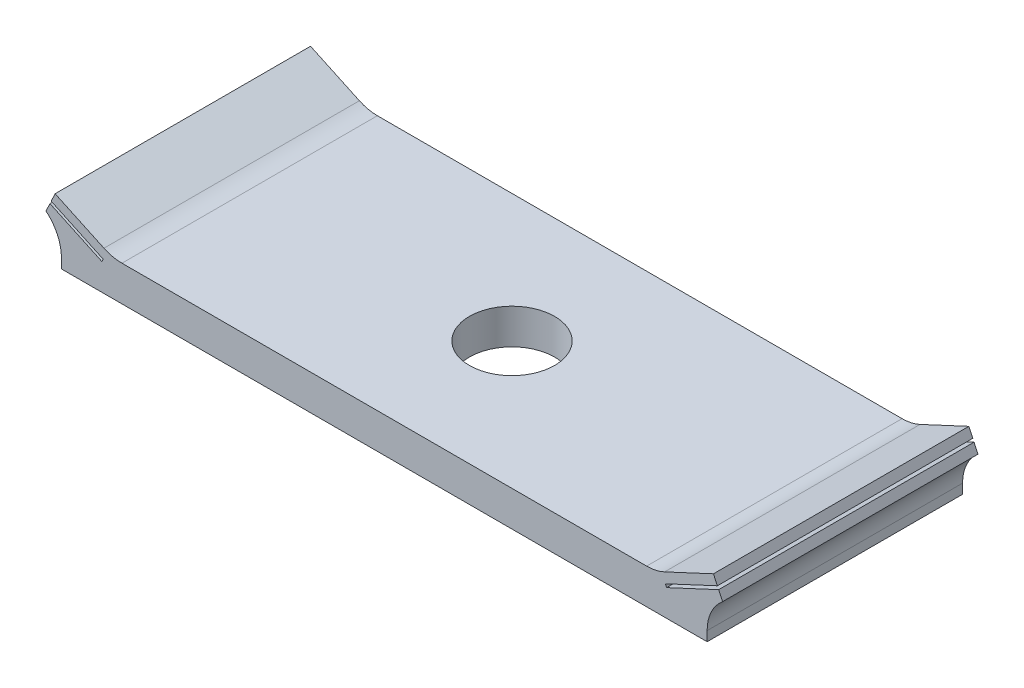
ISO-10303-21;
HEADER;
FILE_DESCRIPTION(('STEP AP214'),'2;1');
FILE_NAME('part.step','',(''),(''),'','','');
FILE_SCHEMA(('AUTOMOTIVE_DESIGN { 1 0 10303 214 1 1 1 1 }'));
ENDSEC;
DATA;
#1=APPLICATION_CONTEXT('core data for automotive mechanical design processes');
#2=APPLICATION_PROTOCOL_DEFINITION('international standard','automotive_design',2000,#1);
#3=PRODUCT_CONTEXT('',#1,'mechanical');
#4=PRODUCT('Part','Part','',(#3));
#5=PRODUCT_RELATED_PRODUCT_CATEGORY('part','',(#4));
#6=PRODUCT_DEFINITION_FORMATION('','',#4);
#7=PRODUCT_DEFINITION_CONTEXT('part definition',#1,'design');
#8=PRODUCT_DEFINITION('design','',#6,#7);
#9=PRODUCT_DEFINITION_SHAPE('','',#8);
#10=(LENGTH_UNIT() NAMED_UNIT(*) SI_UNIT(.MILLI.,.METRE.));
#11=(NAMED_UNIT(*) PLANE_ANGLE_UNIT() SI_UNIT($,.RADIAN.));
#12=(NAMED_UNIT(*) SI_UNIT($,.STERADIAN.) SOLID_ANGLE_UNIT());
#13=UNCERTAINTY_MEASURE_WITH_UNIT(LENGTH_MEASURE(1.E-05),#10,'distance_accuracy_value','');
#14=(GEOMETRIC_REPRESENTATION_CONTEXT(3) GLOBAL_UNCERTAINTY_ASSIGNED_CONTEXT((#13)) GLOBAL_UNIT_ASSIGNED_CONTEXT((#10,
#11,#12)) REPRESENTATION_CONTEXT('',''));
#15=CARTESIAN_POINT('',(0.,0.,0.));
#16=DIRECTION('',(0.,0.,1.));
#17=DIRECTION('',(1.,0.,0.));
#18=AXIS2_PLACEMENT_3D('',#15,#16,#17);
#19=CARTESIAN_POINT('',(0.,2.070510621828,30.));
#20=DIRECTION('',(0.,1.,0.));
#21=DIRECTION('',(0.,0.,1.));
#22=AXIS2_PLACEMENT_3D('',#19,#20,#21);
#23=PLANE('',#22);
#24=CARTESIAN_POINT('',(0.,2.070510621828,15.));
#25=DIRECTION('',(0.,1.,0.));
#26=DIRECTION('',(0.,0.,1.));
#27=AXIS2_PLACEMENT_3D('',#24,#25,#26);
#28=CIRCLE('',#27,5.);
#29=CARTESIAN_POINT('',(0.,2.070510621828,20.));
#30=VERTEX_POINT('',#29);
#31=EDGE_CURVE('E476',#30,#30,#28,.T.);
#32=ORIENTED_EDGE('',*,*,#31,.F.);
#33=EDGE_LOOP('',(#32));
#34=FACE_BOUND('',#33,.T.);
#35=DIRECTION('',(1.,0.,0.));
#36=VECTOR('',#35,1.);
#37=CARTESIAN_POINT('',(0.,2.070510621828,30.));
#38=LINE('',#37,#36);
#39=CARTESIAN_POINT('',(-30.8115266867853,2.070510621828,30.));
#40=VERTEX_POINT('',#39);
#41=CARTESIAN_POINT('',(30.8115266867853,2.070510621828,30.));
#42=VERTEX_POINT('',#41);
#43=EDGE_CURVE('E200',#40,#42,#38,.T.);
#44=ORIENTED_EDGE('',*,*,#43,.T.);
#45=DIRECTION('',(0.,0.,-1.));
#46=VECTOR('',#45,1.);
#47=CARTESIAN_POINT('',(30.8115266867853,2.070510621828,30.));
#48=LINE('',#47,#46);
#49=CARTESIAN_POINT('',(30.8115266867853,2.070510621828,0.));
#50=VERTEX_POINT('',#49);
#51=EDGE_CURVE('E364',#42,#50,#48,.T.);
#52=ORIENTED_EDGE('',*,*,#51,.T.);
#53=DIRECTION('',(1.,0.,0.));
#54=VECTOR('',#53,1.);
#55=CARTESIAN_POINT('',(0.,2.070510621828,0.));
#56=LINE('',#55,#54);
#57=CARTESIAN_POINT('',(-30.8115266867853,2.070510621828,0.));
#58=VERTEX_POINT('',#57);
#59=EDGE_CURVE('E255',#58,#50,#56,.T.);
#60=ORIENTED_EDGE('',*,*,#59,.F.);
#61=DIRECTION('',(0.,0.,-1.));
#62=VECTOR('',#61,1.);
#63=CARTESIAN_POINT('',(-30.8115266867853,2.070510621828,30.));
#64=LINE('',#63,#62);
#65=EDGE_CURVE('E361',#58,#40,#64,.F.);
#66=ORIENTED_EDGE('',*,*,#65,.T.);
#67=EDGE_LOOP('',(#44,#52,#60,#66));
#68=FACE_BOUND('',#67,.T.);
#69=ADVANCED_FACE('F45',(#34,#68),#23,.T.);
#70=CARTESIAN_POINT('',(-4.90805817126778,-10.5253647145472,30.));
#71=DIRECTION('',(0.422618261740701,0.906307787036649,0.));
#72=DIRECTION('',(-0.906307787036649,0.422618261740701,0.));
#73=AXIS2_PLACEMENT_3D('',#70,#71,#72);
#74=PLANE('',#73);
#75=DIRECTION('',(0.90630778703665,-0.422618261740701,0.));
#76=VECTOR('',#75,1.);
#77=CARTESIAN_POINT('',(-4.90805817126778,-10.5253647145472,30.));
#78=LINE('',#77,#76);
#79=CARTESIAN_POINT('',(-38.6609784031329,5.21388047466634,30.));
#80=VERTEX_POINT('',#79);
#81=CARTESIAN_POINT('',(-32.9246179954888,2.53897168664476,30.));
#82=VERTEX_POINT('',#81);
#83=EDGE_CURVE('E185',#80,#82,#78,.T.);
#84=ORIENTED_EDGE('',*,*,#83,.T.);
#85=DIRECTION('',(0.,0.,-1.));
#86=VECTOR('',#85,1.);
#87=CARTESIAN_POINT('',(-32.9246179954888,2.53897168664475,0.));
#88=LINE('',#87,#86);
#89=CARTESIAN_POINT('',(-32.9246179954888,2.53897168664476,0.));
#90=VERTEX_POINT('',#89);
#91=EDGE_CURVE('E371',#82,#90,#88,.T.);
#92=ORIENTED_EDGE('',*,*,#91,.T.);
#93=DIRECTION('',(0.90630778703665,-0.422618261740701,0.));
#94=VECTOR('',#93,1.);
#95=CARTESIAN_POINT('',(-4.90805817126778,-10.5253647145472,0.));
#96=LINE('',#95,#94);
#97=CARTESIAN_POINT('',(-38.6609784031329,5.21388047466634,0.));
#98=VERTEX_POINT('',#97);
#99=EDGE_CURVE('E187',#98,#90,#96,.T.);
#100=ORIENTED_EDGE('',*,*,#99,.F.);
#101=DIRECTION('',(0.,0.,-1.));
#102=VECTOR('',#101,1.);
#103=CARTESIAN_POINT('',(-38.6609784031329,5.21388047466634,30.));
#104=LINE('',#103,#102);
#105=EDGE_CURVE('E183',#80,#98,#104,.T.);
#106=ORIENTED_EDGE('',*,*,#105,.F.);
#107=EDGE_LOOP('',(#84,#92,#100,#106));
#108=FACE_BOUND('',#107,.T.);
#109=ADVANCED_FACE('F184',(#108),#74,.T.);
#110=CARTESIAN_POINT('',(-33.7529202318651,15.7392451892135,30.));
#111=DIRECTION('',(-0.906307787036649,0.4226182617407,0.));
#112=DIRECTION('',(-0.4226182617407,-0.906307787036649,0.));
#113=AXIS2_PLACEMENT_3D('',#110,#111,#112);
#114=PLANE('',#113);
#115=DIRECTION('',(0.4226182617407,0.90630778703665,0.));
#116=VECTOR('',#115,1.);
#117=CARTESIAN_POINT('',(-33.7529202318651,15.7392451892135,0.));
#118=LINE('',#117,#116);
#119=CARTESIAN_POINT('',(-39.1228387927985,4.22341767271929,0.));
#120=VERTEX_POINT('',#119);
#121=EDGE_CURVE('E261',#120,#98,#118,.T.);
#122=ORIENTED_EDGE('',*,*,#121,.F.);
#123=DIRECTION('',(0.,0.,-1.));
#124=VECTOR('',#123,1.);
#125=CARTESIAN_POINT('',(-39.1228387927985,4.22341767271929,30.));
#126=LINE('',#125,#124);
#127=CARTESIAN_POINT('',(-39.1228387927985,4.22341767271929,30.));
#128=VERTEX_POINT('',#127);
#129=EDGE_CURVE('E194',#128,#120,#126,.T.);
#130=ORIENTED_EDGE('',*,*,#129,.F.);
#131=DIRECTION('',(0.4226182617407,0.90630778703665,0.));
#132=VECTOR('',#131,1.);
#133=CARTESIAN_POINT('',(-33.7529202318651,15.7392451892135,30.));
#134=LINE('',#133,#132);
#135=EDGE_CURVE('E198',#128,#80,#134,.T.);
#136=ORIENTED_EDGE('',*,*,#135,.T.);
#137=ORIENTED_EDGE('',*,*,#105,.T.);
#138=EDGE_LOOP('',(#122,#130,#136,#137));
#139=FACE_BOUND('',#138,.T.);
#140=ADVANCED_FACE('F202',(#139),#114,.T.);
#141=CARTESIAN_POINT('',(-5.36991856093337,-11.5158275164943,30.));
#142=DIRECTION('',(0.422618261740701,0.906307787036649,0.));
#143=DIRECTION('',(-0.906307787036649,0.422618261740701,0.));
#144=AXIS2_PLACEMENT_3D('',#141,#142,#143);
#145=PLANE('',#144);
#146=DIRECTION('',(0.906307787036649,-0.422618261740701,0.));
#147=VECTOR('',#146,1.);
#148=CARTESIAN_POINT('',(-5.36991856093337,-11.5158275164943,0.));
#149=LINE('',#148,#147);
#150=CARTESIAN_POINT('',(-33.0143243081715,1.37497058858696,0.));
#151=VERTEX_POINT('',#150);
#152=EDGE_CURVE('E264',#120,#151,#149,.T.);
#153=ORIENTED_EDGE('',*,*,#152,.T.);
#154=DIRECTION('',(0.,0.,-1.));
#155=VECTOR('',#154,1.);
#156=CARTESIAN_POINT('',(-33.0143243081715,1.37497058858696,30.));
#157=LINE('',#156,#155);
#158=CARTESIAN_POINT('',(-33.0143243081715,1.37497058858696,30.));
#159=VERTEX_POINT('',#158);
#160=EDGE_CURVE('E349',#159,#151,#157,.T.);
#161=ORIENTED_EDGE('',*,*,#160,.F.);
#162=DIRECTION('',(0.906307787036649,-0.422618261740701,0.));
#163=VECTOR('',#162,1.);
#164=CARTESIAN_POINT('',(-5.36991856093337,-11.5158275164943,30.));
#165=LINE('',#164,#163);
#166=EDGE_CURVE('E205',#128,#159,#165,.T.);
#167=ORIENTED_EDGE('',*,*,#166,.F.);
#168=ORIENTED_EDGE('',*,*,#129,.T.);
#169=EDGE_LOOP('',(#153,#161,#167,#168));
#170=FACE_BOUND('',#169,.T.);
#171=ADVANCED_FACE('F506',(#170),#145,.F.);
#172=CARTESIAN_POINT('',(-27.6444057472382,12.8907981050811,30.));
#173=DIRECTION('',(0.906307787036652,-0.422618261740695,0.));
#174=DIRECTION('',(0.422618261740695,0.906307787036652,0.));
#175=AXIS2_PLACEMENT_3D('',#172,#173,#174);
#176=PLANE('',#175);
#177=DIRECTION('',(-0.422618261740695,-0.906307787036652,0.));
#178=VECTOR('',#177,1.);
#179=CARTESIAN_POINT('',(-27.6444057472382,12.8907981050811,0.));
#180=LINE('',#179,#178);
#181=CARTESIAN_POINT('',(-33.1622406997807,1.05776286312413,0.));
#182=VERTEX_POINT('',#181);
#183=EDGE_CURVE('E267',#151,#182,#180,.T.);
#184=ORIENTED_EDGE('',*,*,#183,.T.);
#185=DIRECTION('',(0.,0.,-1.));
#186=VECTOR('',#185,1.);
#187=CARTESIAN_POINT('',(-33.1622406997807,1.05776286312413,30.));
#188=LINE('',#187,#186);
#189=CARTESIAN_POINT('',(-33.1622406997807,1.05776286312413,30.));
#190=VERTEX_POINT('',#189);
#191=EDGE_CURVE('E345',#190,#182,#188,.T.);
#192=ORIENTED_EDGE('',*,*,#191,.F.);
#193=DIRECTION('',(-0.422618261740695,-0.906307787036652,0.));
#194=VECTOR('',#193,1.);
#195=CARTESIAN_POINT('',(-27.6444057472382,12.8907981050811,30.));
#196=LINE('',#195,#194);
#197=EDGE_CURVE('E208',#159,#190,#196,.T.);
#198=ORIENTED_EDGE('',*,*,#197,.F.);
#199=ORIENTED_EDGE('',*,*,#160,.T.);
#200=EDGE_LOOP('',(#184,#192,#198,#199));
#201=FACE_BOUND('',#200,.T.);
#202=ADVANCED_FACE('F502',(#201),#176,.F.);
#203=CARTESIAN_POINT('',(-5.51783495254257,-11.8330352419571,30.));
#204=DIRECTION('',(-0.4226182617407,-0.90630778703665,0.));
#205=DIRECTION('',(0.90630778703665,-0.4226182617407,0.));
#206=AXIS2_PLACEMENT_3D('',#203,#204,#205);
#207=PLANE('',#206);
#208=DIRECTION('',(-0.90630778703665,0.4226182617407,0.));
#209=VECTOR('',#208,1.);
#210=CARTESIAN_POINT('',(-5.51783495254257,-11.8330352419571,0.));
#211=LINE('',#210,#209);
#212=CARTESIAN_POINT('',(-39.2707551844077,3.90620994725645,0.));
#213=VERTEX_POINT('',#212);
#214=EDGE_CURVE('E270',#182,#213,#211,.T.);
#215=ORIENTED_EDGE('',*,*,#214,.T.);
#216=DIRECTION('',(0.,0.,-1.));
#217=VECTOR('',#216,1.);
#218=CARTESIAN_POINT('',(-39.2707551844077,3.90620994725645,30.));
#219=LINE('',#218,#217);
#220=CARTESIAN_POINT('',(-39.2707551844077,3.90620994725645,30.));
#221=VERTEX_POINT('',#220);
#222=EDGE_CURVE('E342',#221,#213,#219,.T.);
#223=ORIENTED_EDGE('',*,*,#222,.F.);
#224=DIRECTION('',(-0.90630778703665,0.4226182617407,0.));
#225=VECTOR('',#224,1.);
#226=CARTESIAN_POINT('',(-5.51783495254257,-11.8330352419571,30.));
#227=LINE('',#226,#225);
#228=EDGE_CURVE('E214',#190,#221,#227,.T.);
#229=ORIENTED_EDGE('',*,*,#228,.F.);
#230=ORIENTED_EDGE('',*,*,#191,.T.);
#231=EDGE_LOOP('',(#215,#223,#229,#230));
#232=FACE_BOUND('',#231,.T.);
#233=ADVANCED_FACE('F498',(#232),#207,.F.);
#234=CARTESIAN_POINT('',(-33.7529202318651,15.7392451892135,30.));
#235=DIRECTION('',(-0.906307787036649,0.4226182617407,0.));
#236=DIRECTION('',(-0.4226182617407,-0.906307787036649,0.));
#237=AXIS2_PLACEMENT_3D('',#234,#235,#236);
#238=PLANE('',#237);
#239=DIRECTION('',(0.4226182617407,0.90630778703665,0.));
#240=VECTOR('',#239,1.);
#241=CARTESIAN_POINT('',(-33.7529202318651,15.7392451892135,0.));
#242=LINE('',#241,#240);
#243=CARTESIAN_POINT('',(-39.7326155740733,2.9157471453094,0.));
#244=VERTEX_POINT('',#243);
#245=EDGE_CURVE('E274',#244,#213,#242,.T.);
#246=ORIENTED_EDGE('',*,*,#245,.F.);
#247=DIRECTION('',(0.,0.,-1.));
#248=VECTOR('',#247,1.);
#249=CARTESIAN_POINT('',(-39.7326155740733,2.9157471453094,30.));
#250=LINE('',#249,#248);
#251=CARTESIAN_POINT('',(-39.7326155740733,2.9157471453094,30.));
#252=VERTEX_POINT('',#251);
#253=EDGE_CURVE('E338',#252,#244,#250,.T.);
#254=ORIENTED_EDGE('',*,*,#253,.F.);
#255=DIRECTION('',(0.4226182617407,0.90630778703665,0.));
#256=VECTOR('',#255,1.);
#257=CARTESIAN_POINT('',(-33.7529202318651,15.7392451892135,30.));
#258=LINE('',#257,#256);
#259=EDGE_CURVE('E217',#252,#221,#258,.T.);
#260=ORIENTED_EDGE('',*,*,#259,.T.);
#261=ORIENTED_EDGE('',*,*,#222,.T.);
#262=EDGE_LOOP('',(#246,#254,#260,#261));
#263=FACE_BOUND('',#262,.T.);
#264=ADVANCED_FACE('F492',(#263),#238,.T.);
#265=CARTESIAN_POINT('',(-37.92,0.,30.));
#266=DIRECTION('',(-1.,0.,0.));
#267=DIRECTION('',(0.,0.,1.));
#268=AXIS2_PLACEMENT_3D('',#265,#266,#267);
#269=PLANE('',#268);
#270=DIRECTION('',(0.,1.,0.));
#271=VECTOR('',#270,1.);
#272=CARTESIAN_POINT('',(-37.92,0.,30.));
#273=LINE('',#272,#271);
#274=CARTESIAN_POINT('',(-37.92,-2.070510621828,30.));
#275=VERTEX_POINT('',#274);
#276=CARTESIAN_POINT('',(-37.92,-0.93660025872361,30.));
#277=VERTEX_POINT('',#276);
#278=EDGE_CURVE('E221',#275,#277,#273,.T.);
#279=ORIENTED_EDGE('',*,*,#278,.T.);
#280=DIRECTION('',(0.,0.,1.));
#281=VECTOR('',#280,1.);
#282=CARTESIAN_POINT('',(-37.92,-0.93660025872361,0.));
#283=LINE('',#282,#281);
#284=CARTESIAN_POINT('',(-37.92,-0.93660025872361,0.));
#285=VERTEX_POINT('',#284);
#286=EDGE_CURVE('E357',#277,#285,#283,.F.);
#287=ORIENTED_EDGE('',*,*,#286,.T.);
#288=DIRECTION('',(0.,1.,0.));
#289=VECTOR('',#288,1.);
#290=CARTESIAN_POINT('',(-37.92,0.,0.));
#291=LINE('',#290,#289);
#292=CARTESIAN_POINT('',(-37.92,-2.070510621828,0.));
#293=VERTEX_POINT('',#292);
#294=EDGE_CURVE('E278',#293,#285,#291,.T.);
#295=ORIENTED_EDGE('',*,*,#294,.F.);
#296=DIRECTION('',(0.,0.,-1.));
#297=VECTOR('',#296,1.);
#298=CARTESIAN_POINT('',(-37.92,-2.070510621828,30.));
#299=LINE('',#298,#297);
#300=EDGE_CURVE('E335',#275,#293,#299,.T.);
#301=ORIENTED_EDGE('',*,*,#300,.F.);
#302=EDGE_LOOP('',(#279,#287,#295,#301));
#303=FACE_BOUND('',#302,.T.);
#304=ADVANCED_FACE('F433',(#303),#269,.T.);
#305=CARTESIAN_POINT('',(0.,-2.070510621828,30.));
#306=DIRECTION('',(0.,1.,0.));
#307=DIRECTION('',(0.,0.,1.));
#308=AXIS2_PLACEMENT_3D('',#305,#306,#307);
#309=PLANE('',#308);
#310=CARTESIAN_POINT('',(0.,-2.070510621828,15.));
#311=DIRECTION('',(0.,1.,0.));
#312=DIRECTION('',(0.,0.,1.));
#313=AXIS2_PLACEMENT_3D('',#310,#311,#312);
#314=CIRCLE('',#313,5.);
#315=CARTESIAN_POINT('',(0.,-2.070510621828,20.));
#316=VERTEX_POINT('',#315);
#317=EDGE_CURVE('E49',#316,#316,#314,.T.);
#318=ORIENTED_EDGE('',*,*,#317,.T.);
#319=EDGE_LOOP('',(#318));
#320=FACE_BOUND('',#319,.T.);
#321=DIRECTION('',(1.,0.,0.));
#322=VECTOR('',#321,1.);
#323=CARTESIAN_POINT('',(0.,-2.070510621828,0.));
#324=LINE('',#323,#322);
#325=CARTESIAN_POINT('',(37.92,-2.070510621828,0.));
#326=VERTEX_POINT('',#325);
#327=EDGE_CURVE('E282',#293,#326,#324,.T.);
#328=ORIENTED_EDGE('',*,*,#327,.T.);
#329=DIRECTION('',(0.,0.,-1.));
#330=VECTOR('',#329,1.);
#331=CARTESIAN_POINT('',(37.92,-2.070510621828,30.));
#332=LINE('',#331,#330);
#333=CARTESIAN_POINT('',(37.92,-2.070510621828,30.));
#334=VERTEX_POINT('',#333);
#335=EDGE_CURVE('E331',#334,#326,#332,.T.);
#336=ORIENTED_EDGE('',*,*,#335,.F.);
#337=DIRECTION('',(1.,0.,0.));
#338=VECTOR('',#337,1.);
#339=CARTESIAN_POINT('',(0.,-2.070510621828,30.));
#340=LINE('',#339,#338);
#341=EDGE_CURVE('E225',#275,#334,#340,.T.);
#342=ORIENTED_EDGE('',*,*,#341,.F.);
#343=ORIENTED_EDGE('',*,*,#300,.T.);
#344=EDGE_LOOP('',(#328,#336,#342,#343));
#345=FACE_BOUND('',#344,.T.);
#346=ADVANCED_FACE('F439',(#320,#345),#309,.F.);
#347=CARTESIAN_POINT('',(37.92,0.,30.));
#348=DIRECTION('',(-1.,0.,0.));
#349=DIRECTION('',(0.,0.,1.));
#350=AXIS2_PLACEMENT_3D('',#347,#348,#349);
#351=PLANE('',#350);
#352=DIRECTION('',(0.,1.,0.));
#353=VECTOR('',#352,1.);
#354=CARTESIAN_POINT('',(37.92,0.,0.));
#355=LINE('',#354,#353);
#356=CARTESIAN_POINT('',(37.92,-0.93660025872361,0.));
#357=VERTEX_POINT('',#356);
#358=EDGE_CURVE('E285',#326,#357,#355,.T.);
#359=ORIENTED_EDGE('',*,*,#358,.T.);
#360=DIRECTION('',(0.,0.,1.));
#361=VECTOR('',#360,1.);
#362=CARTESIAN_POINT('',(37.92,-0.93660025872361,30.));
#363=LINE('',#362,#361);
#364=CARTESIAN_POINT('',(37.92,-0.93660025872361,30.));
#365=VERTEX_POINT('',#364);
#366=EDGE_CURVE('E193',#357,#365,#363,.T.);
#367=ORIENTED_EDGE('',*,*,#366,.T.);
#368=DIRECTION('',(0.,1.,0.));
#369=VECTOR('',#368,1.);
#370=CARTESIAN_POINT('',(37.92,0.,30.));
#371=LINE('',#370,#369);
#372=EDGE_CURVE('E228',#334,#365,#371,.T.);
#373=ORIENTED_EDGE('',*,*,#372,.F.);
#374=ORIENTED_EDGE('',*,*,#335,.T.);
#375=EDGE_LOOP('',(#359,#367,#373,#374));
#376=FACE_BOUND('',#375,.T.);
#377=ADVANCED_FACE('F485',(#376),#351,.F.);
#378=CARTESIAN_POINT('',(33.7529202318651,15.7392451892135,30.));
#379=DIRECTION('',(-0.906307787036649,-0.4226182617407,0.));
#380=DIRECTION('',(0.4226182617407,-0.906307787036649,0.));
#381=AXIS2_PLACEMENT_3D('',#378,#379,#380);
#382=PLANE('',#381);
#383=DIRECTION('',(-0.4226182617407,0.90630778703665,0.));
#384=VECTOR('',#383,1.);
#385=CARTESIAN_POINT('',(33.7529202318651,15.7392451892135,0.));
#386=LINE('',#385,#384);
#387=CARTESIAN_POINT('',(39.7326155740733,2.9157471453094,0.));
#388=VERTEX_POINT('',#387);
#389=CARTESIAN_POINT('',(39.2707551844077,3.90620994725645,0.));
#390=VERTEX_POINT('',#389);
#391=EDGE_CURVE('E289',#388,#390,#386,.T.);
#392=ORIENTED_EDGE('',*,*,#391,.T.);
#393=DIRECTION('',(0.,0.,-1.));
#394=VECTOR('',#393,1.);
#395=CARTESIAN_POINT('',(39.2707551844077,3.90620994725645,30.));
#396=LINE('',#395,#394);
#397=CARTESIAN_POINT('',(39.2707551844077,3.90620994725645,30.));
#398=VERTEX_POINT('',#397);
#399=EDGE_CURVE('E324',#398,#390,#396,.T.);
#400=ORIENTED_EDGE('',*,*,#399,.F.);
#401=DIRECTION('',(-0.4226182617407,0.90630778703665,0.));
#402=VECTOR('',#401,1.);
#403=CARTESIAN_POINT('',(33.7529202318651,15.7392451892135,30.));
#404=LINE('',#403,#402);
#405=CARTESIAN_POINT('',(39.7326155740733,2.9157471453094,30.));
#406=VERTEX_POINT('',#405);
#407=EDGE_CURVE('E232',#406,#398,#404,.T.);
#408=ORIENTED_EDGE('',*,*,#407,.F.);
#409=DIRECTION('',(0.,0.,-1.));
#410=VECTOR('',#409,1.);
#411=CARTESIAN_POINT('',(39.7326155740733,2.9157471453094,30.));
#412=LINE('',#411,#410);
#413=EDGE_CURVE('E327',#406,#388,#412,.T.);
#414=ORIENTED_EDGE('',*,*,#413,.T.);
#415=EDGE_LOOP('',(#392,#400,#408,#414));
#416=FACE_BOUND('',#415,.T.);
#417=ADVANCED_FACE('F448',(#416),#382,.F.);
#418=CARTESIAN_POINT('',(5.51783495254257,-11.8330352419571,30.));
#419=DIRECTION('',(-0.4226182617407,0.90630778703665,0.));
#420=DIRECTION('',(-0.90630778703665,-0.4226182617407,0.));
#421=AXIS2_PLACEMENT_3D('',#418,#419,#420);
#422=PLANE('',#421);
#423=DIRECTION('',(0.90630778703665,0.4226182617407,0.));
#424=VECTOR('',#423,1.);
#425=CARTESIAN_POINT('',(5.51783495254257,-11.8330352419571,0.));
#426=LINE('',#425,#424);
#427=CARTESIAN_POINT('',(33.1622406997807,1.05776286312413,0.));
#428=VERTEX_POINT('',#427);
#429=EDGE_CURVE('E293',#428,#390,#426,.T.);
#430=ORIENTED_EDGE('',*,*,#429,.F.);
#431=DIRECTION('',(0.,0.,-1.));
#432=VECTOR('',#431,1.);
#433=CARTESIAN_POINT('',(33.1622406997807,1.05776286312413,30.));
#434=LINE('',#433,#432);
#435=CARTESIAN_POINT('',(33.1622406997807,1.05776286312413,30.));
#436=VERTEX_POINT('',#435);
#437=EDGE_CURVE('E321',#436,#428,#434,.T.);
#438=ORIENTED_EDGE('',*,*,#437,.F.);
#439=DIRECTION('',(0.90630778703665,0.4226182617407,0.));
#440=VECTOR('',#439,1.);
#441=CARTESIAN_POINT('',(5.51783495254257,-11.8330352419571,30.));
#442=LINE('',#441,#440);
#443=EDGE_CURVE('E235',#436,#398,#442,.T.);
#444=ORIENTED_EDGE('',*,*,#443,.T.);
#445=ORIENTED_EDGE('',*,*,#399,.T.);
#446=EDGE_LOOP('',(#430,#438,#444,#445));
#447=FACE_BOUND('',#446,.T.);
#448=ADVANCED_FACE('F454',(#447),#422,.T.);
#449=CARTESIAN_POINT('',(27.6444057472382,12.8907981050811,30.));
#450=DIRECTION('',(0.906307787036652,0.422618261740695,0.));
#451=DIRECTION('',(-0.422618261740695,0.906307787036652,0.));
#452=AXIS2_PLACEMENT_3D('',#449,#450,#451);
#453=PLANE('',#452);
#454=DIRECTION('',(0.422618261740695,-0.906307787036652,0.));
#455=VECTOR('',#454,1.);
#456=CARTESIAN_POINT('',(27.6444057472382,12.8907981050811,0.));
#457=LINE('',#456,#455);
#458=CARTESIAN_POINT('',(33.0143243081715,1.37497058858696,0.));
#459=VERTEX_POINT('',#458);
#460=EDGE_CURVE('E297',#459,#428,#457,.T.);
#461=ORIENTED_EDGE('',*,*,#460,.F.);
#462=DIRECTION('',(0.,0.,-1.));
#463=VECTOR('',#462,1.);
#464=CARTESIAN_POINT('',(33.0143243081715,1.37497058858696,30.));
#465=LINE('',#464,#463);
#466=CARTESIAN_POINT('',(33.0143243081715,1.37497058858696,30.));
#467=VERTEX_POINT('',#466);
#468=EDGE_CURVE('E318',#467,#459,#465,.T.);
#469=ORIENTED_EDGE('',*,*,#468,.F.);
#470=DIRECTION('',(0.422618261740695,-0.906307787036652,0.));
#471=VECTOR('',#470,1.);
#472=CARTESIAN_POINT('',(27.6444057472382,12.8907981050811,30.));
#473=LINE('',#472,#471);
#474=EDGE_CURVE('E239',#467,#436,#473,.T.);
#475=ORIENTED_EDGE('',*,*,#474,.T.);
#476=ORIENTED_EDGE('',*,*,#437,.T.);
#477=EDGE_LOOP('',(#461,#469,#475,#476));
#478=FACE_BOUND('',#477,.T.);
#479=ADVANCED_FACE('F459',(#478),#453,.T.);
#480=CARTESIAN_POINT('',(5.36991856093337,-11.5158275164943,30.));
#481=DIRECTION('',(0.422618261740701,-0.906307787036649,0.));
#482=DIRECTION('',(0.906307787036649,0.422618261740701,0.));
#483=AXIS2_PLACEMENT_3D('',#480,#481,#482);
#484=PLANE('',#483);
#485=DIRECTION('',(-0.906307787036649,-0.422618261740701,0.));
#486=VECTOR('',#485,1.);
#487=CARTESIAN_POINT('',(5.36991856093337,-11.5158275164943,0.));
#488=LINE('',#487,#486);
#489=CARTESIAN_POINT('',(39.1228387927985,4.22341767271929,0.));
#490=VERTEX_POINT('',#489);
#491=EDGE_CURVE('E301',#490,#459,#488,.T.);
#492=ORIENTED_EDGE('',*,*,#491,.F.);
#493=DIRECTION('',(0.,0.,-1.));
#494=VECTOR('',#493,1.);
#495=CARTESIAN_POINT('',(39.1228387927985,4.22341767271929,30.));
#496=LINE('',#495,#494);
#497=CARTESIAN_POINT('',(39.1228387927985,4.22341767271929,30.));
#498=VERTEX_POINT('',#497);
#499=EDGE_CURVE('E315',#498,#490,#496,.T.);
#500=ORIENTED_EDGE('',*,*,#499,.F.);
#501=DIRECTION('',(-0.906307787036649,-0.422618261740701,0.));
#502=VECTOR('',#501,1.);
#503=CARTESIAN_POINT('',(5.36991856093337,-11.5158275164943,30.));
#504=LINE('',#503,#502);
#505=EDGE_CURVE('E243',#498,#467,#504,.T.);
#506=ORIENTED_EDGE('',*,*,#505,.T.);
#507=ORIENTED_EDGE('',*,*,#468,.T.);
#508=EDGE_LOOP('',(#492,#500,#506,#507));
#509=FACE_BOUND('',#508,.T.);
#510=ADVANCED_FACE('F462',(#509),#484,.T.);
#511=CARTESIAN_POINT('',(33.7529202318651,15.7392451892135,30.));
#512=DIRECTION('',(-0.906307787036649,-0.4226182617407,0.));
#513=DIRECTION('',(0.4226182617407,-0.906307787036649,0.));
#514=AXIS2_PLACEMENT_3D('',#511,#512,#513);
#515=PLANE('',#514);
#516=DIRECTION('',(-0.4226182617407,0.90630778703665,0.));
#517=VECTOR('',#516,1.);
#518=CARTESIAN_POINT('',(33.7529202318651,15.7392451892135,0.));
#519=LINE('',#518,#517);
#520=CARTESIAN_POINT('',(38.6609784031329,5.21388047466634,0.));
#521=VERTEX_POINT('',#520);
#522=EDGE_CURVE('E305',#490,#521,#519,.T.);
#523=ORIENTED_EDGE('',*,*,#522,.T.);
#524=DIRECTION('',(0.,0.,-1.));
#525=VECTOR('',#524,1.);
#526=CARTESIAN_POINT('',(38.6609784031329,5.21388047466634,30.));
#527=LINE('',#526,#525);
#528=CARTESIAN_POINT('',(38.6609784031329,5.21388047466634,30.));
#529=VERTEX_POINT('',#528);
#530=EDGE_CURVE('E254',#529,#521,#527,.T.);
#531=ORIENTED_EDGE('',*,*,#530,.F.);
#532=DIRECTION('',(-0.4226182617407,0.90630778703665,0.));
#533=VECTOR('',#532,1.);
#534=CARTESIAN_POINT('',(33.7529202318651,15.7392451892135,30.));
#535=LINE('',#534,#533);
#536=EDGE_CURVE('E247',#498,#529,#535,.T.);
#537=ORIENTED_EDGE('',*,*,#536,.F.);
#538=ORIENTED_EDGE('',*,*,#499,.T.);
#539=EDGE_LOOP('',(#523,#531,#537,#538));
#540=FACE_BOUND('',#539,.T.);
#541=ADVANCED_FACE('F468',(#540),#515,.F.);
#542=CARTESIAN_POINT('',(4.90805817126778,-10.5253647145472,30.));
#543=DIRECTION('',(0.422618261740701,-0.906307787036649,0.));
#544=DIRECTION('',(0.906307787036649,0.422618261740701,0.));
#545=AXIS2_PLACEMENT_3D('',#542,#543,#544);
#546=PLANE('',#545);
#547=DIRECTION('',(-0.90630778703665,-0.422618261740701,0.));
#548=VECTOR('',#547,1.);
#549=CARTESIAN_POINT('',(4.90805817126778,-10.5253647145472,0.));
#550=LINE('',#549,#548);
#551=CARTESIAN_POINT('',(32.9246179954888,2.53897168664476,0.));
#552=VERTEX_POINT('',#551);
#553=EDGE_CURVE('E308',#521,#552,#550,.T.);
#554=ORIENTED_EDGE('',*,*,#553,.T.);
#555=DIRECTION('',(0.,0.,-1.));
#556=VECTOR('',#555,1.);
#557=CARTESIAN_POINT('',(32.9246179954888,2.53897168664475,30.));
#558=LINE('',#557,#556);
#559=CARTESIAN_POINT('',(32.9246179954888,2.53897168664476,30.));
#560=VERTEX_POINT('',#559);
#561=EDGE_CURVE('E368',#552,#560,#558,.F.);
#562=ORIENTED_EDGE('',*,*,#561,.T.);
#563=DIRECTION('',(-0.90630778703665,-0.422618261740701,0.));
#564=VECTOR('',#563,1.);
#565=CARTESIAN_POINT('',(4.90805817126778,-10.5253647145472,30.));
#566=LINE('',#565,#564);
#567=EDGE_CURVE('E250',#529,#560,#566,.T.);
#568=ORIENTED_EDGE('',*,*,#567,.F.);
#569=ORIENTED_EDGE('',*,*,#530,.T.);
#570=EDGE_LOOP('',(#554,#562,#568,#569));
#571=FACE_BOUND('',#570,.T.);
#572=ADVANCED_FACE('F472',(#571),#546,.F.);
#573=CARTESIAN_POINT('',(0.,0.,30.));
#574=DIRECTION('',(0.,0.,1.));
#575=DIRECTION('',(1.,0.,0.));
#576=AXIS2_PLACEMENT_3D('',#573,#574,#575);
#577=PLANE('',#576);
#578=ORIENTED_EDGE('',*,*,#43,.F.);
#579=CARTESIAN_POINT('',(-30.8115266867853,7.070510621828,30.));
#580=DIRECTION('',(0.,0.,1.));
#581=DIRECTION('',(1.,0.,0.));
#582=AXIS2_PLACEMENT_3D('',#579,#580,#581);
#583=CIRCLE('',#582,5.);
#584=EDGE_CURVE('E11',#40,#82,#583,.F.);
#585=ORIENTED_EDGE('',*,*,#584,.T.);
#586=ORIENTED_EDGE('',*,*,#83,.F.);
#587=ORIENTED_EDGE('',*,*,#135,.F.);
#588=ORIENTED_EDGE('',*,*,#166,.T.);
#589=ORIENTED_EDGE('',*,*,#197,.T.);
#590=ORIENTED_EDGE('',*,*,#228,.T.);
#591=ORIENTED_EDGE('',*,*,#259,.F.);
#592=CARTESIAN_POINT('',(-42.92,-0.93660025872361,30.));
#593=DIRECTION('',(0.,0.,1.));
#594=DIRECTION('',(1.,0.,0.));
#595=AXIS2_PLACEMENT_3D('',#592,#593,#594);
#596=CIRCLE('',#595,5.);
#597=EDGE_CURVE('E383',#252,#277,#596,.F.);
#598=ORIENTED_EDGE('',*,*,#597,.T.);
#599=ORIENTED_EDGE('',*,*,#278,.F.);
#600=ORIENTED_EDGE('',*,*,#341,.T.);
#601=ORIENTED_EDGE('',*,*,#372,.T.);
#602=CARTESIAN_POINT('',(42.92,-0.93660025872361,30.));
#603=DIRECTION('',(0.,0.,1.));
#604=DIRECTION('',(1.,0.,0.));
#605=AXIS2_PLACEMENT_3D('',#602,#603,#604);
#606=CIRCLE('',#605,5.);
#607=EDGE_CURVE('E377',#365,#406,#606,.F.);
#608=ORIENTED_EDGE('',*,*,#607,.T.);
#609=ORIENTED_EDGE('',*,*,#407,.T.);
#610=ORIENTED_EDGE('',*,*,#443,.F.);
#611=ORIENTED_EDGE('',*,*,#474,.F.);
#612=ORIENTED_EDGE('',*,*,#505,.F.);
#613=ORIENTED_EDGE('',*,*,#536,.T.);
#614=ORIENTED_EDGE('',*,*,#567,.T.);
#615=CARTESIAN_POINT('',(30.8115266867853,7.070510621828,30.));
#616=DIRECTION('',(0.,0.,1.));
#617=DIRECTION('',(1.,0.,0.));
#618=AXIS2_PLACEMENT_3D('',#615,#616,#617);
#619=CIRCLE('',#618,5.);
#620=EDGE_CURVE('E389',#560,#42,#619,.F.);
#621=ORIENTED_EDGE('',*,*,#620,.T.);
#622=EDGE_LOOP('',(#578,#585,#586,#587,#588,#589,#590,#591,#598,#599,#600,#601,#608,#609,#610,
#611,#612,#613,#614,#621));
#623=FACE_BOUND('',#622,.T.);
#624=ADVANCED_FACE('F197',(#623),#577,.T.);
#625=CARTESIAN_POINT('',(0.,0.,0.));
#626=DIRECTION('',(0.,0.,1.));
#627=DIRECTION('',(1.,0.,0.));
#628=AXIS2_PLACEMENT_3D('',#625,#626,#627);
#629=PLANE('',#628);
#630=ORIENTED_EDGE('',*,*,#99,.T.);
#631=CARTESIAN_POINT('',(-30.8115266867853,7.070510621828,0.));
#632=DIRECTION('',(0.,0.,1.));
#633=DIRECTION('',(1.,0.,0.));
#634=AXIS2_PLACEMENT_3D('',#631,#632,#633);
#635=CIRCLE('',#634,5.);
#636=EDGE_CURVE('E55',#90,#58,#635,.T.);
#637=ORIENTED_EDGE('',*,*,#636,.T.);
#638=ORIENTED_EDGE('',*,*,#59,.T.);
#639=CARTESIAN_POINT('',(30.8115266867853,7.070510621828,0.));
#640=DIRECTION('',(0.,0.,1.));
#641=DIRECTION('',(1.,0.,0.));
#642=AXIS2_PLACEMENT_3D('',#639,#640,#641);
#643=CIRCLE('',#642,5.);
#644=EDGE_CURVE('E386',#50,#552,#643,.T.);
#645=ORIENTED_EDGE('',*,*,#644,.T.);
#646=ORIENTED_EDGE('',*,*,#553,.F.);
#647=ORIENTED_EDGE('',*,*,#522,.F.);
#648=ORIENTED_EDGE('',*,*,#491,.T.);
#649=ORIENTED_EDGE('',*,*,#460,.T.);
#650=ORIENTED_EDGE('',*,*,#429,.T.);
#651=ORIENTED_EDGE('',*,*,#391,.F.);
#652=CARTESIAN_POINT('',(42.92,-0.93660025872361,0.));
#653=DIRECTION('',(0.,0.,1.));
#654=DIRECTION('',(1.,0.,0.));
#655=AXIS2_PLACEMENT_3D('',#652,#653,#654);
#656=CIRCLE('',#655,5.);
#657=EDGE_CURVE('E374',#388,#357,#656,.T.);
#658=ORIENTED_EDGE('',*,*,#657,.T.);
#659=ORIENTED_EDGE('',*,*,#358,.F.);
#660=ORIENTED_EDGE('',*,*,#327,.F.);
#661=ORIENTED_EDGE('',*,*,#294,.T.);
#662=CARTESIAN_POINT('',(-42.92,-0.93660025872361,0.));
#663=DIRECTION('',(0.,0.,1.));
#664=DIRECTION('',(1.,0.,0.));
#665=AXIS2_PLACEMENT_3D('',#662,#663,#664);
#666=CIRCLE('',#665,5.);
#667=EDGE_CURVE('E380',#285,#244,#666,.T.);
#668=ORIENTED_EDGE('',*,*,#667,.T.);
#669=ORIENTED_EDGE('',*,*,#245,.T.);
#670=ORIENTED_EDGE('',*,*,#214,.F.);
#671=ORIENTED_EDGE('',*,*,#183,.F.);
#672=ORIENTED_EDGE('',*,*,#152,.F.);
#673=ORIENTED_EDGE('',*,*,#121,.T.);
#674=EDGE_LOOP('',(#630,#637,#638,#645,#646,#647,#648,#649,#650,#651,#658,#659,#660,#661,#668,
#669,#670,#671,#672,#673));
#675=FACE_BOUND('',#674,.T.);
#676=ADVANCED_FACE('F395',(#675),#629,.F.);
#677=CARTESIAN_POINT('',(42.92,-0.93660025872361,30.));
#678=DIRECTION('',(0.,0.,1.));
#679=DIRECTION('',(1.,0.,0.));
#680=AXIS2_PLACEMENT_3D('',#677,#678,#679);
#681=CYLINDRICAL_SURFACE('',#680,5.);
#682=ORIENTED_EDGE('',*,*,#607,.F.);
#683=ORIENTED_EDGE('',*,*,#366,.F.);
#684=ORIENTED_EDGE('',*,*,#657,.F.);
#685=ORIENTED_EDGE('',*,*,#413,.F.);
#686=EDGE_LOOP('',(#682,#683,#684,#685));
#687=FACE_BOUND('',#686,.T.);
#688=ADVANCED_FACE('F420',(#687),#681,.F.);
#689=CARTESIAN_POINT('',(-42.92,-0.93660025872361,30.));
#690=DIRECTION('',(0.,0.,-1.));
#691=DIRECTION('',(-1.,0.,0.));
#692=AXIS2_PLACEMENT_3D('',#689,#690,#691);
#693=CYLINDRICAL_SURFACE('',#692,5.);
#694=ORIENTED_EDGE('',*,*,#597,.F.);
#695=ORIENTED_EDGE('',*,*,#253,.T.);
#696=ORIENTED_EDGE('',*,*,#667,.F.);
#697=ORIENTED_EDGE('',*,*,#286,.F.);
#698=EDGE_LOOP('',(#694,#695,#696,#697));
#699=FACE_BOUND('',#698,.T.);
#700=ADVANCED_FACE('F408',(#699),#693,.F.);
#701=CARTESIAN_POINT('',(30.8115266867853,7.070510621828,30.));
#702=DIRECTION('',(0.,0.,-1.));
#703=DIRECTION('',(-1.,0.,0.));
#704=AXIS2_PLACEMENT_3D('',#701,#702,#703);
#705=CYLINDRICAL_SURFACE('',#704,5.);
#706=ORIENTED_EDGE('',*,*,#620,.F.);
#707=ORIENTED_EDGE('',*,*,#561,.F.);
#708=ORIENTED_EDGE('',*,*,#644,.F.);
#709=ORIENTED_EDGE('',*,*,#51,.F.);
#710=EDGE_LOOP('',(#706,#707,#708,#709));
#711=FACE_BOUND('',#710,.T.);
#712=ADVANCED_FACE('F401',(#711),#705,.F.);
#713=CARTESIAN_POINT('',(-30.8115266867853,7.070510621828,30.));
#714=DIRECTION('',(0.,0.,1.));
#715=DIRECTION('',(1.,0.,0.));
#716=AXIS2_PLACEMENT_3D('',#713,#714,#715);
#717=CYLINDRICAL_SURFACE('',#716,5.);
#718=ORIENTED_EDGE('',*,*,#584,.F.);
#719=ORIENTED_EDGE('',*,*,#65,.F.);
#720=ORIENTED_EDGE('',*,*,#636,.F.);
#721=ORIENTED_EDGE('',*,*,#91,.F.);
#722=EDGE_LOOP('',(#718,#719,#720,#721));
#723=FACE_BOUND('',#722,.T.);
#724=ADVANCED_FACE('F47',(#723),#717,.F.);
#725=CARTESIAN_POINT('',(0.,-27.929489378172,15.));
#726=DIRECTION('',(0.,1.,0.));
#727=DIRECTION('',(0.,0.,1.));
#728=AXIS2_PLACEMENT_3D('',#725,#726,#727);
#729=CYLINDRICAL_SURFACE('',#728,5.);
#730=ORIENTED_EDGE('',*,*,#31,.T.);
#731=EDGE_LOOP('',(#730));
#732=FACE_BOUND('',#731,.T.);
#733=ORIENTED_EDGE('',*,*,#317,.F.);
#734=EDGE_LOOP('',(#733));
#735=FACE_BOUND('',#734,.T.);
#736=ADVANCED_FACE('F400',(#732,#735),#729,.F.);
#737=CLOSED_SHELL('',(#69,#109,#140,#171,#202,#233,#264,#304,#346,#377,#417,#448,#479,#510,#541,
#572,#624,#676,#688,#700,#712,#724,#736));
#738=MANIFOLD_SOLID_BREP('B2',#737);
#739=ADVANCED_BREP_SHAPE_REPRESENTATION('',(#18,#738),#14);
#740=SHAPE_DEFINITION_REPRESENTATION(#9,#739);
ENDSEC;
END-ISO-10303-21;
